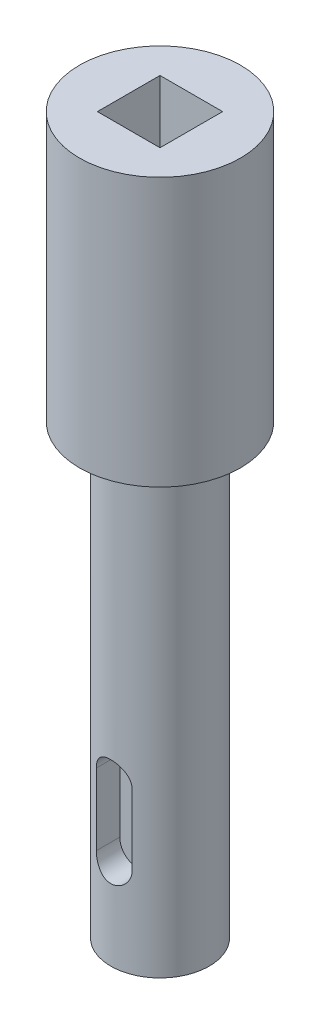
ISO-10303-21;
HEADER;
FILE_DESCRIPTION(('STEP AP214'),'2;1');
FILE_NAME('part.step','',(''),(''),'','','');
FILE_SCHEMA(('AUTOMOTIVE_DESIGN { 1 0 10303 214 1 1 1 1 }'));
ENDSEC;
DATA;
#1=APPLICATION_CONTEXT('core data for automotive mechanical design processes');
#2=APPLICATION_PROTOCOL_DEFINITION('international standard','automotive_design',2000,#1);
#3=PRODUCT_CONTEXT('',#1,'mechanical');
#4=PRODUCT('Part','Part','',(#3));
#5=PRODUCT_RELATED_PRODUCT_CATEGORY('part','',(#4));
#6=PRODUCT_DEFINITION_FORMATION('','',#4);
#7=PRODUCT_DEFINITION_CONTEXT('part definition',#1,'design');
#8=PRODUCT_DEFINITION('design','',#6,#7);
#9=PRODUCT_DEFINITION_SHAPE('','',#8);
#10=(LENGTH_UNIT() NAMED_UNIT(*) SI_UNIT(.MILLI.,.METRE.));
#11=(NAMED_UNIT(*) PLANE_ANGLE_UNIT() SI_UNIT($,.RADIAN.));
#12=(NAMED_UNIT(*) SI_UNIT($,.STERADIAN.) SOLID_ANGLE_UNIT());
#13=UNCERTAINTY_MEASURE_WITH_UNIT(LENGTH_MEASURE(1.E-05),#10,'distance_accuracy_value','');
#14=(GEOMETRIC_REPRESENTATION_CONTEXT(3) GLOBAL_UNCERTAINTY_ASSIGNED_CONTEXT((#13)) GLOBAL_UNIT_ASSIGNED_CONTEXT((#10,
#11,#12)) REPRESENTATION_CONTEXT('',''));
#15=CARTESIAN_POINT('',(0.,0.,0.));
#16=DIRECTION('',(0.,0.,1.));
#17=DIRECTION('',(1.,0.,0.));
#18=AXIS2_PLACEMENT_3D('',#15,#16,#17);
#19=CARTESIAN_POINT('',(0.,0.,0.));
#20=DIRECTION('',(0.,1.,0.));
#21=DIRECTION('',(0.,0.,1.));
#22=AXIS2_PLACEMENT_3D('',#19,#20,#21);
#23=PLANE('',#22);
#24=CARTESIAN_POINT('',(0.,0.,0.));
#25=DIRECTION('',(0.,-1.,0.));
#26=DIRECTION('',(0.,0.,-1.));
#27=AXIS2_PLACEMENT_3D('',#24,#25,#26);
#28=CIRCLE('',#27,5.5);
#29=CARTESIAN_POINT('',(0.,0.,-5.5));
#30=VERTEX_POINT('',#29);
#31=EDGE_CURVE('E168',#30,#30,#28,.T.);
#32=ORIENTED_EDGE('',*,*,#31,.T.);
#33=EDGE_LOOP('',(#32));
#34=FACE_BOUND('',#33,.T.);
#35=ADVANCED_FACE('F34',(#34),#23,.F.);
#36=CARTESIAN_POINT('',(0.,0.,0.));
#37=DIRECTION('',(0.,-1.,0.));
#38=DIRECTION('',(0.,0.,-1.));
#39=AXIS2_PLACEMENT_3D('',#36,#37,#38);
#40=CYLINDRICAL_SURFACE('',#39,5.5);
#41=DIRECTION('',(0.,-1.,0.));
#42=VECTOR('',#41,1.);
#43=CARTESIAN_POINT('',(-2.,0.,5.1234753829798));
#44=LINE('',#43,#42);
#45=CARTESIAN_POINT('',(-2.,10.,5.1234753829798));
#46=VERTEX_POINT('',#45);
#47=CARTESIAN_POINT('',(-2.,18.,5.1234753829798));
#48=VERTEX_POINT('',#47);
#49=EDGE_CURVE('E11',#46,#48,#44,.F.);
#50=ORIENTED_EDGE('',*,*,#49,.T.);
#51=CARTESIAN_POINT('',(-2.,18.,5.1234753829798));
#52=CARTESIAN_POINT('',(-2.00000753314808,18.0542387794215,5.12346565602725));
#53=CARTESIAN_POINT('',(-1.99779379827409,18.1084722006855,5.12433643557664));
#54=CARTESIAN_POINT('',(-1.98898255908266,18.2165113091841,5.12776648446225));
#55=CARTESIAN_POINT('',(-1.98238644308809,18.2703171264209,5.13032521905848));
#56=CARTESIAN_POINT('',(-1.96489870016483,18.3769386378676,5.13704737724638));
#57=CARTESIAN_POINT('',(-1.95402164560881,18.4297570608448,5.14120535590845));
#58=CARTESIAN_POINT('',(-1.92808800203303,18.5342059488466,5.15098705807193));
#59=CARTESIAN_POINT('',(-1.91303121833357,18.5858363584157,5.15661084984592));
#60=CARTESIAN_POINT('',(-1.86180702208756,18.7383380578886,5.1754238494232));
#61=CARTESIAN_POINT('',(-1.81955567746145,18.8370007851342,5.19056699295785));
#62=CARTESIAN_POINT('',(-1.72018049401623,19.025864717297,5.22433904658501));
#63=CARTESIAN_POINT('',(-1.6630453414404,19.1160594140772,5.24297060531306));
#64=CARTESIAN_POINT('',(-1.53267714707823,19.2896373955808,5.28258709667611));
#65=CARTESIAN_POINT('',(-1.45886670296494,19.3725728466475,5.30363814939348));
#66=CARTESIAN_POINT('',(-1.29847293044524,19.5251983915152,5.34516826987225));
#67=CARTESIAN_POINT('',(-1.21188719525374,19.5948859838287,5.36564722898827));
#68=CARTESIAN_POINT('',(-1.02500969613479,19.7211816005164,5.40451062749925));
#69=CARTESIAN_POINT('',(-0.924370090053194,19.7773041853689,5.42280793854183));
#70=CARTESIAN_POINT('',(-0.714299107302071,19.87163583463,5.45445105820857));
#71=CARTESIAN_POINT('',(-0.604870855549388,19.9098512334287,5.46779861738183));
#72=CARTESIAN_POINT('',(-0.385063057544166,19.9657201005735,5.48756774300281));
#73=CARTESIAN_POINT('',(-0.274904403065941,19.9841487401052,5.49424962399435));
#74=CARTESIAN_POINT('',(-0.0528669835238525,20.0023993811456,5.50086592457488));
#75=CARTESIAN_POINT('',(0.0590112772595822,20.0022267372473,5.50080228593927));
#76=CARTESIAN_POINT('',(0.275772559853018,19.9837418899724,5.49410312303007));
#77=CARTESIAN_POINT('',(0.38073872526241,19.9662747515696,5.487773764585));
#78=CARTESIAN_POINT('',(0.586131937099523,19.9151117433146,5.46965116666239));
#79=CARTESIAN_POINT('',(0.686558725995574,19.8814149539694,5.45785761761182));
#80=CARTESIAN_POINT('',(0.881716601365395,19.7983289035465,5.42977365386104));
#81=CARTESIAN_POINT('',(0.976346250593864,19.7487230729347,5.41342161172991));
#82=CARTESIAN_POINT('',(1.15616748204336,19.6354142151825,5.37788902184763));
#83=CARTESIAN_POINT('',(1.24135610896621,19.5717067924578,5.35870759277619));
#84=CARTESIAN_POINT('',(1.40486489489799,19.4278846047878,5.31825524364858));
#85=CARTESIAN_POINT('',(1.48254558886144,19.3470578404106,5.29692743161349));
#86=CARTESIAN_POINT('',(1.62349341794031,19.1733630945193,5.25544299978234));
#87=CARTESIAN_POINT('',(1.68675521974002,19.0804906773774,5.23528681539943));
#88=CARTESIAN_POINT('',(1.79820509788062,18.8829391885399,5.19807570266242));
#89=CARTESIAN_POINT('',(1.84606144182333,18.7780588656343,5.18109196181225));
#90=CARTESIAN_POINT('',(1.92314470149137,18.5610024449834,5.15298201497764));
#91=CARTESIAN_POINT('',(1.95240231114569,18.4488387062451,5.14184616339463));
#92=CARTESIAN_POINT('',(1.98115331401841,18.2796212160958,5.13080109153432));
#93=CARTESIAN_POINT('',(1.98821538805374,18.2239410881613,5.12806368923518));
#94=CARTESIAN_POINT('',(1.99763703693586,18.1121845642489,5.12439847706826));
#95=CARTESIAN_POINT('',(2.00000152980534,18.0561086444467,5.12346877469309));
#96=CARTESIAN_POINT('',(2.,18.,5.1234753829798));
#97=B_SPLINE_CURVE_WITH_KNOTS('',3,(#51,#52,#53,#54,#55,#56,#57,#58,#59,#60,#61,#62,#63,#64,#65,
#66,#67,#68,#69,#70,#71,#72,#73,#74,#75,#76,#77,#78,#79,#80,#81,#82,#83,#84,#85,#86,#87,#88,#89,
#90,#91,#92,#93,#94,#95,#96),.UNSPECIFIED.,.F.,.F.,(4,2,2,2,2,2,2,2,2,2,2,2,2,2,2,2,2,2,2,2,2,2,
4),(0.,0.162655197714174,0.325258891390911,0.487313801745629,0.649376261416068,
0.972956522661164,1.29678347113773,1.63427074689126,1.97182168451613,2.32008820197742,
2.66823143237219,3.00217322695472,3.33601889281301,3.65431862991543,3.97263640245517,
4.29548576025188,4.61843589496831,4.95922780644115,5.30014556751896,5.64797750864198,
5.99523391397707,6.16361511870676,6.33181994758313),.UNSPECIFIED.);
#98=CARTESIAN_POINT('',(2.,18.,5.1234753829798));
#99=VERTEX_POINT('',#98);
#100=EDGE_CURVE('E171',#48,#99,#97,.T.);
#101=ORIENTED_EDGE('',*,*,#100,.T.);
#102=DIRECTION('',(0.,-1.,0.));
#103=VECTOR('',#102,1.);
#104=CARTESIAN_POINT('',(2.,0.,5.1234753829798));
#105=LINE('',#104,#103);
#106=CARTESIAN_POINT('',(2.,10.,5.1234753829798));
#107=VERTEX_POINT('',#106);
#108=EDGE_CURVE('E41',#99,#107,#105,.T.);
#109=ORIENTED_EDGE('',*,*,#108,.T.);
#110=CARTESIAN_POINT('',(2.,10.,5.1234753829798));
#111=CARTESIAN_POINT('',(2.00000753314808,9.9457612205785,5.12346565602725));
#112=CARTESIAN_POINT('',(1.99779379827409,9.89152779931448,5.12433643557664));
#113=CARTESIAN_POINT('',(1.98898255908266,9.78348869081595,5.12776648446225));
#114=CARTESIAN_POINT('',(1.98238644308809,9.72968287357905,5.13032521905848));
#115=CARTESIAN_POINT('',(1.96489870016483,9.62306136213237,5.13704737724638));
#116=CARTESIAN_POINT('',(1.95402164560881,9.57024293915523,5.14120535590845));
#117=CARTESIAN_POINT('',(1.92808800203303,9.46579405115342,5.15098705807193));
#118=CARTESIAN_POINT('',(1.91303121833357,9.4141636415843,5.15661084984592));
#119=CARTESIAN_POINT('',(1.86180702208756,9.26166194211137,5.1754238494232));
#120=CARTESIAN_POINT('',(1.81955567746144,9.16299921486576,5.19056699295785));
#121=CARTESIAN_POINT('',(1.72018049401623,8.97413528270298,5.22433904658501));
#122=CARTESIAN_POINT('',(1.6630453414404,8.8839405859228,5.24297060531306));
#123=CARTESIAN_POINT('',(1.53267714707823,8.71036260441923,5.28258709667612));
#124=CARTESIAN_POINT('',(1.45886670296494,8.62742715335248,5.30363814939348));
#125=CARTESIAN_POINT('',(1.29847293044523,8.47480160848479,5.34516826987225));
#126=CARTESIAN_POINT('',(1.21188719525374,8.40511401617131,5.36564722898827));
#127=CARTESIAN_POINT('',(1.02500969613479,8.27881839948359,5.40451062749924));
#128=CARTESIAN_POINT('',(0.924370090053193,8.22269581463109,5.42280793854183));
#129=CARTESIAN_POINT('',(0.71429910730207,8.12836416537001,5.45445105820857));
#130=CARTESIAN_POINT('',(0.604870855549387,8.09014876657132,5.46779861738183));
#131=CARTESIAN_POINT('',(0.385063057544166,8.03427989942651,5.48756774300281));
#132=CARTESIAN_POINT('',(0.274904403065941,8.01585125989477,5.49424962399435));
#133=CARTESIAN_POINT('',(0.0528669835238519,7.99760061885444,5.50086592457488));
#134=CARTESIAN_POINT('',(-0.0590112772595827,7.99777326275275,5.50080228593927));
#135=CARTESIAN_POINT('',(-0.275772559853019,8.01625811002759,5.49410312303007));
#136=CARTESIAN_POINT('',(-0.380738725262411,8.03372524843044,5.487773764585));
#137=CARTESIAN_POINT('',(-0.586131937099525,8.08488825668537,5.46965116666239));
#138=CARTESIAN_POINT('',(-0.686558725995576,8.11858504603058,5.45785761761182));
#139=CARTESIAN_POINT('',(-0.881716601365396,8.20167109645351,5.42977365386104));
#140=CARTESIAN_POINT('',(-0.976346250593864,8.25127692706534,5.41342161172991));
#141=CARTESIAN_POINT('',(-1.15616748204336,8.36458578481754,5.37788902184763));
#142=CARTESIAN_POINT('',(-1.24135610896621,8.42829320754222,5.35870759277619));
#143=CARTESIAN_POINT('',(-1.404864894898,8.57211539521224,5.31825524364858));
#144=CARTESIAN_POINT('',(-1.48254558886144,8.65294215958938,5.29692743161349));
#145=CARTESIAN_POINT('',(-1.62349341794031,8.8266369054807,5.25544299978234));
#146=CARTESIAN_POINT('',(-1.68675521974002,8.91950932262257,5.23528681539943));
#147=CARTESIAN_POINT('',(-1.79820509788062,9.11706081146008,5.19807570266242));
#148=CARTESIAN_POINT('',(-1.84606144182333,9.22194113436572,5.18109196181224));
#149=CARTESIAN_POINT('',(-1.92314470149137,9.43899755501663,5.15298201497763));
#150=CARTESIAN_POINT('',(-1.95240231114569,9.55116129375495,5.14184616339463));
#151=CARTESIAN_POINT('',(-1.98115331401841,9.72037878390417,5.13080109153432));
#152=CARTESIAN_POINT('',(-1.98821538805374,9.77605891183874,5.12806368923517));
#153=CARTESIAN_POINT('',(-1.99763703693586,9.8878154357511,5.12439847706825));
#154=CARTESIAN_POINT('',(-2.00000152980534,9.94389135555327,5.12346877469309));
#155=CARTESIAN_POINT('',(-2.,10.,5.1234753829798));
#156=B_SPLINE_CURVE_WITH_KNOTS('',3,(#110,#111,#112,#113,#114,#115,#116,#117,#118,#119,#120,
#121,#122,#123,#124,#125,#126,#127,#128,#129,#130,#131,#132,#133,#134,#135,#136,#137,#138,#139,
#140,#141,#142,#143,#144,#145,#146,#147,#148,#149,#150,#151,#152,#153,#154,#155),.UNSPECIFIED.,
.F.,.F.,(4,2,2,2,2,2,2,2,2,2,2,2,2,2,2,2,2,2,2,2,2,2,4),(0.,0.162655197714174,0.325258891390913,
0.487313801745628,0.649376261416068,0.972956522661167,1.29678347113774,1.63427074689126,
1.97182168451614,2.32008820197742,2.66823143237219,3.00217322695472,3.33601889281301,
3.65431862991543,3.97263640245517,4.29548576025188,4.61843589496831,4.95922780644116,
5.30014556751897,5.64797750864199,5.99523391397708,6.16361511870677,6.33181994758313),.UNSPECIFIED.);
#157=EDGE_CURVE('E48',#107,#46,#156,.T.);
#158=ORIENTED_EDGE('',*,*,#157,.T.);
#159=EDGE_LOOP('',(#50,#101,#109,#158));
#160=FACE_BOUND('',#159,.T.);
#161=ORIENTED_EDGE('',*,*,#31,.F.);
#162=EDGE_LOOP('',(#161));
#163=FACE_BOUND('',#162,.T.);
#164=CARTESIAN_POINT('',(0.,50.,0.));
#165=DIRECTION('',(0.,-1.,0.));
#166=DIRECTION('',(0.,0.,-1.));
#167=AXIS2_PLACEMENT_3D('',#164,#165,#166);
#168=CIRCLE('',#167,5.5);
#169=CARTESIAN_POINT('',(0.,50.,-5.5));
#170=VERTEX_POINT('',#169);
#171=EDGE_CURVE('E165',#170,#170,#168,.T.);
#172=ORIENTED_EDGE('',*,*,#171,.T.);
#173=EDGE_LOOP('',(#172));
#174=FACE_BOUND('',#173,.T.);
#175=ADVANCED_FACE('F182',(#160,#163,#174),#40,.T.);
#176=CARTESIAN_POINT('',(-5.5,50.,0.));
#177=DIRECTION('',(0.,1.,0.));
#178=DIRECTION('',(0.,0.,1.));
#179=AXIS2_PLACEMENT_3D('',#176,#177,#178);
#180=PLANE('',#179);
#181=ORIENTED_EDGE('',*,*,#171,.F.);
#182=EDGE_LOOP('',(#181));
#183=FACE_BOUND('',#182,.T.);
#184=CARTESIAN_POINT('',(0.,50.,0.));
#185=DIRECTION('',(0.,-1.,0.));
#186=DIRECTION('',(0.,0.,-1.));
#187=AXIS2_PLACEMENT_3D('',#184,#185,#186);
#188=CIRCLE('',#187,9.);
#189=CARTESIAN_POINT('',(0.,50.,-9.));
#190=VERTEX_POINT('',#189);
#191=EDGE_CURVE('E162',#190,#190,#188,.T.);
#192=ORIENTED_EDGE('',*,*,#191,.T.);
#193=EDGE_LOOP('',(#192));
#194=FACE_BOUND('',#193,.T.);
#195=ADVANCED_FACE('F222',(#183,#194),#180,.F.);
#196=CARTESIAN_POINT('',(0.,0.,0.));
#197=DIRECTION('',(0.,-1.,0.));
#198=DIRECTION('',(0.,0.,-1.));
#199=AXIS2_PLACEMENT_3D('',#196,#197,#198);
#200=CYLINDRICAL_SURFACE('',#199,9.);
#201=ORIENTED_EDGE('',*,*,#191,.F.);
#202=EDGE_LOOP('',(#201));
#203=FACE_BOUND('',#202,.T.);
#204=CARTESIAN_POINT('',(0.,80.,0.));
#205=DIRECTION('',(0.,-1.,0.));
#206=DIRECTION('',(0.,0.,-1.));
#207=AXIS2_PLACEMENT_3D('',#204,#205,#206);
#208=CIRCLE('',#207,9.);
#209=CARTESIAN_POINT('',(0.,80.,-9.));
#210=VERTEX_POINT('',#209);
#211=EDGE_CURVE('E154',#210,#210,#208,.T.);
#212=ORIENTED_EDGE('',*,*,#211,.T.);
#213=EDGE_LOOP('',(#212));
#214=FACE_BOUND('',#213,.T.);
#215=ADVANCED_FACE('F219',(#203,#214),#200,.T.);
#216=CARTESIAN_POINT('',(0.,80.,0.));
#217=DIRECTION('',(0.,-1.,0.));
#218=DIRECTION('',(0.,0.,-1.));
#219=AXIS2_PLACEMENT_3D('',#216,#217,#218);
#220=PLANE('',#219);
#221=DIRECTION('',(-1.,0.,0.));
#222=VECTOR('',#221,1.);
#223=CARTESIAN_POINT('',(-3.5,80.,-3.5));
#224=LINE('',#223,#222);
#225=CARTESIAN_POINT('',(3.5,80.,-3.5));
#226=VERTEX_POINT('',#225);
#227=CARTESIAN_POINT('',(-3.5,80.,-3.5));
#228=VERTEX_POINT('',#227);
#229=EDGE_CURVE('E144',#226,#228,#224,.T.);
#230=ORIENTED_EDGE('',*,*,#229,.F.);
#231=DIRECTION('',(0.,0.,-1.));
#232=VECTOR('',#231,1.);
#233=CARTESIAN_POINT('',(3.5,80.,3.5));
#234=LINE('',#233,#232);
#235=CARTESIAN_POINT('',(3.5,80.,3.5));
#236=VERTEX_POINT('',#235);
#237=EDGE_CURVE('E56',#236,#226,#234,.T.);
#238=ORIENTED_EDGE('',*,*,#237,.F.);
#239=DIRECTION('',(1.,0.,0.));
#240=VECTOR('',#239,1.);
#241=CARTESIAN_POINT('',(-3.5,80.,3.5));
#242=LINE('',#241,#240);
#243=CARTESIAN_POINT('',(-3.5,80.,3.5));
#244=VERTEX_POINT('',#243);
#245=EDGE_CURVE('E133',#244,#236,#242,.T.);
#246=ORIENTED_EDGE('',*,*,#245,.F.);
#247=DIRECTION('',(0.,0.,1.));
#248=VECTOR('',#247,1.);
#249=CARTESIAN_POINT('',(-3.5,80.,3.5));
#250=LINE('',#249,#248);
#251=EDGE_CURVE('E147',#228,#244,#250,.T.);
#252=ORIENTED_EDGE('',*,*,#251,.F.);
#253=EDGE_LOOP('',(#230,#238,#246,#252));
#254=FACE_BOUND('',#253,.T.);
#255=ORIENTED_EDGE('',*,*,#211,.F.);
#256=EDGE_LOOP('',(#255));
#257=FACE_BOUND('',#256,.T.);
#258=ADVANCED_FACE('F216',(#254,#257),#220,.F.);
#259=CARTESIAN_POINT('',(3.5,60.,3.5));
#260=DIRECTION('',(1.,0.,0.));
#261=DIRECTION('',(0.,0.,-1.));
#262=AXIS2_PLACEMENT_3D('',#259,#260,#261);
#263=PLANE('',#262);
#264=ORIENTED_EDGE('',*,*,#237,.T.);
#265=DIRECTION('',(0.,1.,0.));
#266=VECTOR('',#265,1.);
#267=CARTESIAN_POINT('',(3.5,60.,-3.5));
#268=LINE('',#267,#266);
#269=CARTESIAN_POINT('',(3.5,60.,-3.5));
#270=VERTEX_POINT('',#269);
#271=EDGE_CURVE('E142',#270,#226,#268,.T.);
#272=ORIENTED_EDGE('',*,*,#271,.F.);
#273=DIRECTION('',(0.,0.,-1.));
#274=VECTOR('',#273,1.);
#275=CARTESIAN_POINT('',(3.5,60.,3.5));
#276=LINE('',#275,#274);
#277=CARTESIAN_POINT('',(3.5,60.,3.5));
#278=VERTEX_POINT('',#277);
#279=EDGE_CURVE('E129',#278,#270,#276,.T.);
#280=ORIENTED_EDGE('',*,*,#279,.F.);
#281=DIRECTION('',(0.,1.,0.));
#282=VECTOR('',#281,1.);
#283=CARTESIAN_POINT('',(3.5,60.,3.5));
#284=LINE('',#283,#282);
#285=EDGE_CURVE('E152',#278,#236,#284,.T.);
#286=ORIENTED_EDGE('',*,*,#285,.T.);
#287=EDGE_LOOP('',(#264,#272,#280,#286));
#288=FACE_BOUND('',#287,.T.);
#289=ADVANCED_FACE('F206',(#288),#263,.F.);
#290=CARTESIAN_POINT('',(-3.5,60.,3.5));
#291=DIRECTION('',(0.,0.,1.));
#292=DIRECTION('',(1.,0.,0.));
#293=AXIS2_PLACEMENT_3D('',#290,#291,#292);
#294=PLANE('',#293);
#295=ORIENTED_EDGE('',*,*,#245,.T.);
#296=ORIENTED_EDGE('',*,*,#285,.F.);
#297=DIRECTION('',(1.,0.,0.));
#298=VECTOR('',#297,1.);
#299=CARTESIAN_POINT('',(-3.5,60.,3.5));
#300=LINE('',#299,#298);
#301=CARTESIAN_POINT('',(-3.5,60.,3.5));
#302=VERTEX_POINT('',#301);
#303=EDGE_CURVE('E139',#302,#278,#300,.T.);
#304=ORIENTED_EDGE('',*,*,#303,.F.);
#305=DIRECTION('',(0.,1.,0.));
#306=VECTOR('',#305,1.);
#307=CARTESIAN_POINT('',(-3.5,60.,3.5));
#308=LINE('',#307,#306);
#309=EDGE_CURVE('E155',#302,#244,#308,.T.);
#310=ORIENTED_EDGE('',*,*,#309,.T.);
#311=EDGE_LOOP('',(#295,#296,#304,#310));
#312=FACE_BOUND('',#311,.T.);
#313=ADVANCED_FACE('F202',(#312),#294,.F.);
#314=CARTESIAN_POINT('',(-3.5,60.,3.5));
#315=DIRECTION('',(-1.,0.,0.));
#316=DIRECTION('',(0.,0.,1.));
#317=AXIS2_PLACEMENT_3D('',#314,#315,#316);
#318=PLANE('',#317);
#319=ORIENTED_EDGE('',*,*,#251,.T.);
#320=ORIENTED_EDGE('',*,*,#309,.F.);
#321=DIRECTION('',(0.,0.,1.));
#322=VECTOR('',#321,1.);
#323=CARTESIAN_POINT('',(-3.5,60.,3.5));
#324=LINE('',#323,#322);
#325=CARTESIAN_POINT('',(-3.5,60.,-3.5));
#326=VERTEX_POINT('',#325);
#327=EDGE_CURVE('E136',#326,#302,#324,.T.);
#328=ORIENTED_EDGE('',*,*,#327,.F.);
#329=DIRECTION('',(0.,1.,0.));
#330=VECTOR('',#329,1.);
#331=CARTESIAN_POINT('',(-3.5,60.,-3.5));
#332=LINE('',#331,#330);
#333=EDGE_CURVE('E157',#326,#228,#332,.T.);
#334=ORIENTED_EDGE('',*,*,#333,.T.);
#335=EDGE_LOOP('',(#319,#320,#328,#334));
#336=FACE_BOUND('',#335,.T.);
#337=ADVANCED_FACE('F205',(#336),#318,.F.);
#338=CARTESIAN_POINT('',(-3.5,60.,-3.5));
#339=DIRECTION('',(0.,0.,-1.));
#340=DIRECTION('',(-1.,0.,0.));
#341=AXIS2_PLACEMENT_3D('',#338,#339,#340);
#342=PLANE('',#341);
#343=ORIENTED_EDGE('',*,*,#229,.T.);
#344=ORIENTED_EDGE('',*,*,#333,.F.);
#345=DIRECTION('',(-1.,0.,0.));
#346=VECTOR('',#345,1.);
#347=CARTESIAN_POINT('',(-3.5,60.,-3.5));
#348=LINE('',#347,#346);
#349=EDGE_CURVE('E132',#270,#326,#348,.T.);
#350=ORIENTED_EDGE('',*,*,#349,.F.);
#351=ORIENTED_EDGE('',*,*,#271,.T.);
#352=EDGE_LOOP('',(#343,#344,#350,#351));
#353=FACE_BOUND('',#352,.T.);
#354=ADVANCED_FACE('F200',(#353),#342,.F.);
#355=CARTESIAN_POINT('',(0.,60.,0.));
#356=DIRECTION('',(0.,-1.,0.));
#357=DIRECTION('',(0.,0.,-1.));
#358=AXIS2_PLACEMENT_3D('',#355,#356,#357);
#359=PLANE('',#358);
#360=ORIENTED_EDGE('',*,*,#279,.T.);
#361=ORIENTED_EDGE('',*,*,#349,.T.);
#362=ORIENTED_EDGE('',*,*,#327,.T.);
#363=ORIENTED_EDGE('',*,*,#303,.T.);
#364=EDGE_LOOP('',(#360,#361,#362,#363));
#365=FACE_BOUND('',#364,.T.);
#366=ADVANCED_FACE('F197',(#365),#359,.F.);
#367=CARTESIAN_POINT('',(0.,10.,2.5));
#368=DIRECTION('',(0.,0.,1.));
#369=DIRECTION('',(1.,0.,0.));
#370=AXIS2_PLACEMENT_3D('',#367,#368,#369);
#371=CYLINDRICAL_SURFACE('',#370,2.);
#372=DIRECTION('',(0.,0.,1.));
#373=VECTOR('',#372,1.);
#374=CARTESIAN_POINT('',(2.,10.,2.5));
#375=LINE('',#374,#373);
#376=CARTESIAN_POINT('',(2.,10.,2.5));
#377=VERTEX_POINT('',#376);
#378=EDGE_CURVE('E97',#377,#107,#375,.T.);
#379=ORIENTED_EDGE('',*,*,#378,.F.);
#380=CARTESIAN_POINT('',(0.,10.,2.5));
#381=DIRECTION('',(0.,0.,1.));
#382=DIRECTION('',(1.,0.,0.));
#383=AXIS2_PLACEMENT_3D('',#380,#381,#382);
#384=CIRCLE('',#383,2.);
#385=CARTESIAN_POINT('',(-2.,10.,2.5));
#386=VERTEX_POINT('',#385);
#387=EDGE_CURVE('E101',#386,#377,#384,.T.);
#388=ORIENTED_EDGE('',*,*,#387,.F.);
#389=DIRECTION('',(0.,0.,1.));
#390=VECTOR('',#389,1.);
#391=CARTESIAN_POINT('',(-2.,10.,2.5));
#392=LINE('',#391,#390);
#393=EDGE_CURVE('E123',#386,#46,#392,.T.);
#394=ORIENTED_EDGE('',*,*,#393,.T.);
#395=ORIENTED_EDGE('',*,*,#157,.F.);
#396=EDGE_LOOP('',(#379,#388,#394,#395));
#397=FACE_BOUND('',#396,.T.);
#398=ADVANCED_FACE('F99',(#397),#371,.F.);
#399=CARTESIAN_POINT('',(-2.,10.,2.5));
#400=DIRECTION('',(-1.,0.,0.));
#401=DIRECTION('',(0.,0.,1.));
#402=AXIS2_PLACEMENT_3D('',#399,#400,#401);
#403=PLANE('',#402);
#404=ORIENTED_EDGE('',*,*,#393,.F.);
#405=DIRECTION('',(0.,-1.,0.));
#406=VECTOR('',#405,1.);
#407=CARTESIAN_POINT('',(-2.,10.,2.5));
#408=LINE('',#407,#406);
#409=CARTESIAN_POINT('',(-2.,18.,2.5));
#410=VERTEX_POINT('',#409);
#411=EDGE_CURVE('E106',#410,#386,#408,.T.);
#412=ORIENTED_EDGE('',*,*,#411,.F.);
#413=DIRECTION('',(0.,0.,1.));
#414=VECTOR('',#413,1.);
#415=CARTESIAN_POINT('',(-2.,18.,2.5));
#416=LINE('',#415,#414);
#417=EDGE_CURVE('E125',#410,#48,#416,.T.);
#418=ORIENTED_EDGE('',*,*,#417,.T.);
#419=ORIENTED_EDGE('',*,*,#49,.F.);
#420=EDGE_LOOP('',(#404,#412,#418,#419));
#421=FACE_BOUND('',#420,.T.);
#422=ADVANCED_FACE('F190',(#421),#403,.F.);
#423=CARTESIAN_POINT('',(0.,18.,2.5));
#424=DIRECTION('',(0.,0.,1.));
#425=DIRECTION('',(1.,0.,0.));
#426=AXIS2_PLACEMENT_3D('',#423,#424,#425);
#427=CYLINDRICAL_SURFACE('',#426,2.);
#428=ORIENTED_EDGE('',*,*,#417,.F.);
#429=CARTESIAN_POINT('',(0.,18.,2.5));
#430=DIRECTION('',(0.,0.,1.));
#431=DIRECTION('',(1.,0.,0.));
#432=AXIS2_PLACEMENT_3D('',#429,#430,#431);
#433=CIRCLE('',#432,2.);
#434=CARTESIAN_POINT('',(2.,18.,2.5));
#435=VERTEX_POINT('',#434);
#436=EDGE_CURVE('E115',#435,#410,#433,.T.);
#437=ORIENTED_EDGE('',*,*,#436,.F.);
#438=DIRECTION('',(0.,0.,1.));
#439=VECTOR('',#438,1.);
#440=CARTESIAN_POINT('',(2.,18.,2.5));
#441=LINE('',#440,#439);
#442=EDGE_CURVE('E105',#435,#99,#441,.T.);
#443=ORIENTED_EDGE('',*,*,#442,.T.);
#444=ORIENTED_EDGE('',*,*,#100,.F.);
#445=EDGE_LOOP('',(#428,#437,#443,#444));
#446=FACE_BOUND('',#445,.T.);
#447=ADVANCED_FACE('F185',(#446),#427,.F.);
#448=CARTESIAN_POINT('',(2.,10.,2.5));
#449=DIRECTION('',(1.,0.,0.));
#450=DIRECTION('',(0.,0.,-1.));
#451=AXIS2_PLACEMENT_3D('',#448,#449,#450);
#452=PLANE('',#451);
#453=ORIENTED_EDGE('',*,*,#442,.F.);
#454=DIRECTION('',(0.,1.,0.));
#455=VECTOR('',#454,1.);
#456=CARTESIAN_POINT('',(2.,10.,2.5));
#457=LINE('',#456,#455);
#458=EDGE_CURVE('E109',#377,#435,#457,.T.);
#459=ORIENTED_EDGE('',*,*,#458,.F.);
#460=ORIENTED_EDGE('',*,*,#378,.T.);
#461=ORIENTED_EDGE('',*,*,#108,.F.);
#462=EDGE_LOOP('',(#453,#459,#460,#461));
#463=FACE_BOUND('',#462,.T.);
#464=ADVANCED_FACE('F110',(#463),#452,.F.);
#465=CARTESIAN_POINT('',(0.,10.,2.5));
#466=DIRECTION('',(0.,0.,1.));
#467=DIRECTION('',(1.,0.,0.));
#468=AXIS2_PLACEMENT_3D('',#465,#466,#467);
#469=PLANE('',#468);
#470=ORIENTED_EDGE('',*,*,#387,.T.);
#471=ORIENTED_EDGE('',*,*,#458,.T.);
#472=ORIENTED_EDGE('',*,*,#436,.T.);
#473=ORIENTED_EDGE('',*,*,#411,.T.);
#474=EDGE_LOOP('',(#470,#471,#472,#473));
#475=FACE_BOUND('',#474,.T.);
#476=ADVANCED_FACE('F117',(#475),#469,.T.);
#477=CLOSED_SHELL('',(#35,#175,#195,#215,#258,#289,#313,#337,#354,#366,#398,#422,#447,#464,#476));
#478=MANIFOLD_SOLID_BREP('B2',#477);
#479=ADVANCED_BREP_SHAPE_REPRESENTATION('',(#18,#478),#14);
#480=SHAPE_DEFINITION_REPRESENTATION(#9,#479);
ENDSEC;
END-ISO-10303-21;
